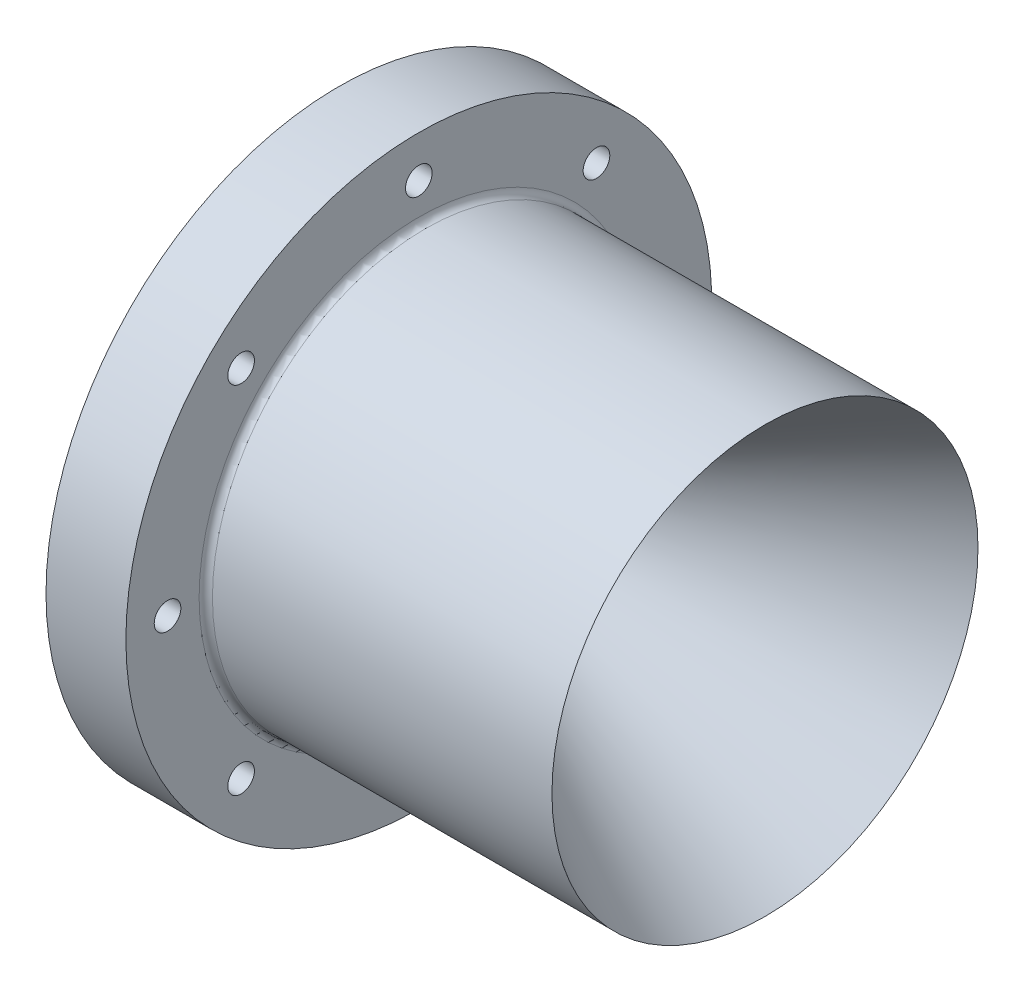
ISO-10303-21;
HEADER;
FILE_DESCRIPTION(('STEP AP214'),'2;1');
FILE_NAME('part.step','',(''),(''),'','','');
FILE_SCHEMA(('AUTOMOTIVE_DESIGN { 1 0 10303 214 1 1 1 1 }'));
ENDSEC;
DATA;
#1=APPLICATION_CONTEXT('core data for automotive mechanical design processes');
#2=APPLICATION_PROTOCOL_DEFINITION('international standard','automotive_design',2000,#1);
#3=PRODUCT_CONTEXT('',#1,'mechanical');
#4=PRODUCT('Part','Part','',(#3));
#5=PRODUCT_RELATED_PRODUCT_CATEGORY('part','',(#4));
#6=PRODUCT_DEFINITION_FORMATION('','',#4);
#7=PRODUCT_DEFINITION_CONTEXT('part definition',#1,'design');
#8=PRODUCT_DEFINITION('design','',#6,#7);
#9=PRODUCT_DEFINITION_SHAPE('','',#8);
#10=(LENGTH_UNIT() NAMED_UNIT(*) SI_UNIT(.MILLI.,.METRE.));
#11=(NAMED_UNIT(*) PLANE_ANGLE_UNIT() SI_UNIT($,.RADIAN.));
#12=(NAMED_UNIT(*) SI_UNIT($,.STERADIAN.) SOLID_ANGLE_UNIT());
#13=UNCERTAINTY_MEASURE_WITH_UNIT(LENGTH_MEASURE(1.E-05),#10,'distance_accuracy_value','');
#14=(GEOMETRIC_REPRESENTATION_CONTEXT(3) GLOBAL_UNCERTAINTY_ASSIGNED_CONTEXT((#13)) GLOBAL_UNIT_ASSIGNED_CONTEXT((#10,
#11,#12)) REPRESENTATION_CONTEXT('',''));
#15=CARTESIAN_POINT('',(0.,0.,0.));
#16=DIRECTION('',(0.,0.,1.));
#17=DIRECTION('',(1.,0.,0.));
#18=AXIS2_PLACEMENT_3D('',#15,#16,#17);
#19=CARTESIAN_POINT('',(0.,0.,0.));
#20=DIRECTION('',(-1.,0.,0.));
#21=DIRECTION('',(0.,0.,1.));
#22=AXIS2_PLACEMENT_3D('',#19,#20,#21);
#23=CYLINDRICAL_SURFACE('',#22,50.8);
#24=CARTESIAN_POINT('',(-9.47210291759363,0.,0.));
#25=DIRECTION('',(-1.,0.,0.));
#26=DIRECTION('',(0.,0.,1.));
#27=AXIS2_PLACEMENT_3D('',#24,#25,#26);
#28=CIRCLE('',#27,50.8);
#29=CARTESIAN_POINT('',(-9.47210291759363,0.,50.8));
#30=VERTEX_POINT('',#29);
#31=EDGE_CURVE('E12',#30,#30,#28,.F.);
#32=ORIENTED_EDGE('',*,*,#31,.T.);
#33=EDGE_LOOP('',(#32));
#34=FACE_BOUND('',#33,.T.);
#35=CARTESIAN_POINT('',(71.4903970824064,0.,0.));
#36=DIRECTION('',(-1.,0.,0.));
#37=DIRECTION('',(0.,0.,1.));
#38=AXIS2_PLACEMENT_3D('',#35,#36,#37);
#39=CIRCLE('',#38,50.8);
#40=CARTESIAN_POINT('',(71.4903970824064,0.,50.8));
#41=VERTEX_POINT('',#40);
#42=EDGE_CURVE('E96',#41,#41,#39,.T.);
#43=ORIENTED_EDGE('',*,*,#42,.T.);
#44=EDGE_LOOP('',(#43));
#45=FACE_BOUND('',#44,.T.);
#46=ADVANCED_FACE('F50',(#34,#45),#23,.T.);
#47=CARTESIAN_POINT('',(-11.0596029175936,69.85,0.));
#48=DIRECTION('',(-1.,0.,0.));
#49=DIRECTION('',(0.,0.,1.));
#50=AXIS2_PLACEMENT_3D('',#47,#48,#49);
#51=PLANE('',#50);
#52=CARTESIAN_POINT('',(-11.0596029175936,0.,0.));
#53=DIRECTION('',(-1.,0.,0.));
#54=DIRECTION('',(0.,0.,1.));
#55=AXIS2_PLACEMENT_3D('',#52,#53,#54);
#56=CIRCLE('',#55,52.3875);
#57=CARTESIAN_POINT('',(-11.0596029175936,0.,52.3875));
#58=VERTEX_POINT('',#57);
#59=EDGE_CURVE('E58',#58,#58,#56,.T.);
#60=ORIENTED_EDGE('',*,*,#59,.T.);
#61=EDGE_LOOP('',(#60));
#62=FACE_BOUND('',#61,.T.);
#63=CARTESIAN_POINT('',(-11.0596029175936,59.9186,0.));
#64=DIRECTION('',(-1.,0.,0.));
#65=DIRECTION('',(0.,0.,1.));
#66=AXIS2_PLACEMENT_3D('',#63,#64,#65);
#67=CIRCLE('',#66,3.175);
#68=CARTESIAN_POINT('',(-11.0596029175936,59.9186,3.175));
#69=VERTEX_POINT('',#68);
#70=EDGE_CURVE('E100',#69,#69,#67,.F.);
#71=ORIENTED_EDGE('',*,*,#70,.F.);
#72=EDGE_LOOP('',(#71));
#73=FACE_BOUND('',#72,.T.);
#74=CARTESIAN_POINT('',(-11.0596029175936,42.3688483792054,42.3688483792047));
#75=DIRECTION('',(-1.,0.,0.));
#76=DIRECTION('',(0.,0.,1.));
#77=AXIS2_PLACEMENT_3D('',#74,#75,#76);
#78=CIRCLE('',#77,3.17500000000024);
#79=CARTESIAN_POINT('',(-11.0596029175936,42.3688483792054,45.543848379205));
#80=VERTEX_POINT('',#79);
#81=EDGE_CURVE('E149',#80,#80,#78,.F.);
#82=ORIENTED_EDGE('',*,*,#81,.F.);
#83=EDGE_LOOP('',(#82));
#84=FACE_BOUND('',#83,.T.);
#85=CARTESIAN_POINT('',(-11.0596029175936,1.61747136534687E-12,59.9186000000016));
#86=DIRECTION('',(-1.,0.,0.));
#87=DIRECTION('',(0.,0.,1.));
#88=AXIS2_PLACEMENT_3D('',#85,#86,#87);
#89=CIRCLE('',#88,3.175);
#90=CARTESIAN_POINT('',(-11.0596029175936,1.61747136534687E-12,63.0936000000016));
#91=VERTEX_POINT('',#90);
#92=EDGE_CURVE('E141',#91,#91,#89,.F.);
#93=ORIENTED_EDGE('',*,*,#92,.F.);
#94=EDGE_LOOP('',(#93));
#95=FACE_BOUND('',#94,.T.);
#96=CARTESIAN_POINT('',(-11.0596029175936,-42.3688483792031,42.368848379207));
#97=DIRECTION('',(-1.,0.,0.));
#98=DIRECTION('',(0.,0.,1.));
#99=AXIS2_PLACEMENT_3D('',#96,#97,#98);
#100=CIRCLE('',#99,3.175);
#101=CARTESIAN_POINT('',(-11.0596029175936,-42.3688483792031,45.543848379207));
#102=VERTEX_POINT('',#101);
#103=EDGE_CURVE('E133',#102,#102,#100,.F.);
#104=ORIENTED_EDGE('',*,*,#103,.F.);
#105=EDGE_LOOP('',(#104));
#106=FACE_BOUND('',#105,.T.);
#107=CARTESIAN_POINT('',(-11.0596029175936,-59.9186,3.23494273069374E-12));
#108=DIRECTION('',(-1.,0.,0.));
#109=DIRECTION('',(0.,0.,1.));
#110=AXIS2_PLACEMENT_3D('',#107,#108,#109);
#111=CIRCLE('',#110,3.175);
#112=CARTESIAN_POINT('',(-11.0596029175936,-59.9186,3.17500000000323));
#113=VERTEX_POINT('',#112);
#114=EDGE_CURVE('E125',#113,#113,#111,.F.);
#115=ORIENTED_EDGE('',*,*,#114,.F.);
#116=EDGE_LOOP('',(#115));
#117=FACE_BOUND('',#116,.T.);
#118=CARTESIAN_POINT('',(-11.0596029175936,-42.3688483792054,-42.3688483792015));
#119=DIRECTION('',(-1.,0.,0.));
#120=DIRECTION('',(0.,0.,1.));
#121=AXIS2_PLACEMENT_3D('',#118,#119,#120);
#122=CIRCLE('',#121,3.175);
#123=CARTESIAN_POINT('',(-11.0596029175936,-42.3688483792054,-39.1938483792015));
#124=VERTEX_POINT('',#123);
#125=EDGE_CURVE('E117',#124,#124,#122,.F.);
#126=ORIENTED_EDGE('',*,*,#125,.F.);
#127=EDGE_LOOP('',(#126));
#128=FACE_BOUND('',#127,.T.);
#129=CARTESIAN_POINT('',(-11.0596029175936,-1.62480927751681E-12,-59.9185999999984));
#130=DIRECTION('',(-1.,0.,0.));
#131=DIRECTION('',(0.,0.,1.));
#132=AXIS2_PLACEMENT_3D('',#129,#130,#131);
#133=CIRCLE('',#132,3.175);
#134=CARTESIAN_POINT('',(-11.0596029175936,-1.62480927751681E-12,-56.7435999999984));
#135=VERTEX_POINT('',#134);
#136=EDGE_CURVE('E110',#135,#135,#133,.F.);
#137=ORIENTED_EDGE('',*,*,#136,.F.);
#138=EDGE_LOOP('',(#137));
#139=FACE_BOUND('',#138,.T.);
#140=CARTESIAN_POINT('',(-11.0596029175936,42.3688483792031,-42.3688483792038));
#141=DIRECTION('',(-1.,0.,0.));
#142=DIRECTION('',(0.,0.,1.));
#143=AXIS2_PLACEMENT_3D('',#140,#141,#142);
#144=CIRCLE('',#143,3.175);
#145=CARTESIAN_POINT('',(-11.0596029175936,42.3688483792031,-39.1938483792038));
#146=VERTEX_POINT('',#145);
#147=EDGE_CURVE('E101',#146,#146,#144,.F.);
#148=ORIENTED_EDGE('',*,*,#147,.F.);
#149=EDGE_LOOP('',(#148));
#150=FACE_BOUND('',#149,.T.);
#151=CARTESIAN_POINT('',(-11.0596029175936,0.,0.));
#152=DIRECTION('',(-1.,0.,0.));
#153=DIRECTION('',(0.,0.,1.));
#154=AXIS2_PLACEMENT_3D('',#151,#152,#153);
#155=CIRCLE('',#154,69.85);
#156=CARTESIAN_POINT('',(-11.0596029175936,0.,69.85));
#157=VERTEX_POINT('',#156);
#158=EDGE_CURVE('E86',#157,#157,#155,.T.);
#159=ORIENTED_EDGE('',*,*,#158,.F.);
#160=EDGE_LOOP('',(#159));
#161=FACE_BOUND('',#160,.T.);
#162=ADVANCED_FACE('F192',(#62,#73,#84,#95,#106,#117,#128,#139,#150,#161),#51,.F.);
#163=CARTESIAN_POINT('',(0.,0.,0.));
#164=DIRECTION('',(-1.,0.,0.));
#165=DIRECTION('',(0.,0.,1.));
#166=AXIS2_PLACEMENT_3D('',#163,#164,#165);
#167=CYLINDRICAL_SURFACE('',#166,69.85);
#168=CARTESIAN_POINT('',(-30.1096029175936,0.,0.));
#169=DIRECTION('',(-1.,0.,0.));
#170=DIRECTION('',(0.,0.,1.));
#171=AXIS2_PLACEMENT_3D('',#168,#169,#170);
#172=CIRCLE('',#171,69.85);
#173=CARTESIAN_POINT('',(-30.1096029175936,0.,69.85));
#174=VERTEX_POINT('',#173);
#175=EDGE_CURVE('E90',#174,#174,#172,.T.);
#176=ORIENTED_EDGE('',*,*,#175,.F.);
#177=EDGE_LOOP('',(#176));
#178=FACE_BOUND('',#177,.T.);
#179=ORIENTED_EDGE('',*,*,#158,.T.);
#180=EDGE_LOOP('',(#179));
#181=FACE_BOUND('',#180,.T.);
#182=ADVANCED_FACE('F170',(#178,#181),#167,.T.);
#183=CARTESIAN_POINT('',(-30.1096029175936,50.8,0.));
#184=DIRECTION('',(1.,0.,0.));
#185=DIRECTION('',(0.,0.,-1.));
#186=AXIS2_PLACEMENT_3D('',#183,#184,#185);
#187=PLANE('',#186);
#188=CARTESIAN_POINT('',(-30.1096029175936,59.9186,0.));
#189=DIRECTION('',(-1.,0.,0.));
#190=DIRECTION('',(0.,0.,1.));
#191=AXIS2_PLACEMENT_3D('',#188,#189,#190);
#192=CIRCLE('',#191,3.175);
#193=CARTESIAN_POINT('',(-30.1096029175936,59.9186,3.175));
#194=VERTEX_POINT('',#193);
#195=EDGE_CURVE('E152',#194,#194,#192,.T.);
#196=ORIENTED_EDGE('',*,*,#195,.F.);
#197=EDGE_LOOP('',(#196));
#198=FACE_BOUND('',#197,.T.);
#199=CARTESIAN_POINT('',(-30.1096029175936,42.3688483792054,42.3688483792047));
#200=DIRECTION('',(-1.,0.,0.));
#201=DIRECTION('',(0.,0.,1.));
#202=AXIS2_PLACEMENT_3D('',#199,#200,#201);
#203=CIRCLE('',#202,3.17500000000024);
#204=CARTESIAN_POINT('',(-30.1096029175936,42.3688483792054,45.543848379205));
#205=VERTEX_POINT('',#204);
#206=EDGE_CURVE('E145',#205,#205,#203,.T.);
#207=ORIENTED_EDGE('',*,*,#206,.F.);
#208=EDGE_LOOP('',(#207));
#209=FACE_BOUND('',#208,.T.);
#210=CARTESIAN_POINT('',(-30.1096029175936,1.61747136534687E-12,59.9186000000016));
#211=DIRECTION('',(-1.,0.,0.));
#212=DIRECTION('',(0.,0.,1.));
#213=AXIS2_PLACEMENT_3D('',#210,#211,#212);
#214=CIRCLE('',#213,3.175);
#215=CARTESIAN_POINT('',(-30.1096029175936,1.61747136534687E-12,63.0936000000016));
#216=VERTEX_POINT('',#215);
#217=EDGE_CURVE('E137',#216,#216,#214,.T.);
#218=ORIENTED_EDGE('',*,*,#217,.F.);
#219=EDGE_LOOP('',(#218));
#220=FACE_BOUND('',#219,.T.);
#221=CARTESIAN_POINT('',(-30.1096029175936,-42.3688483792031,42.368848379207));
#222=DIRECTION('',(-1.,0.,0.));
#223=DIRECTION('',(0.,0.,1.));
#224=AXIS2_PLACEMENT_3D('',#221,#222,#223);
#225=CIRCLE('',#224,3.175);
#226=CARTESIAN_POINT('',(-30.1096029175936,-42.3688483792031,45.543848379207));
#227=VERTEX_POINT('',#226);
#228=EDGE_CURVE('E129',#227,#227,#225,.T.);
#229=ORIENTED_EDGE('',*,*,#228,.F.);
#230=EDGE_LOOP('',(#229));
#231=FACE_BOUND('',#230,.T.);
#232=CARTESIAN_POINT('',(-30.1096029175936,-59.9186,3.23494273069374E-12));
#233=DIRECTION('',(-1.,0.,0.));
#234=DIRECTION('',(0.,0.,1.));
#235=AXIS2_PLACEMENT_3D('',#232,#233,#234);
#236=CIRCLE('',#235,3.175);
#237=CARTESIAN_POINT('',(-30.1096029175936,-59.9186,3.17500000000323));
#238=VERTEX_POINT('',#237);
#239=EDGE_CURVE('E121',#238,#238,#236,.T.);
#240=ORIENTED_EDGE('',*,*,#239,.F.);
#241=EDGE_LOOP('',(#240));
#242=FACE_BOUND('',#241,.T.);
#243=CARTESIAN_POINT('',(-30.1096029175936,-42.3688483792054,-42.3688483792015));
#244=DIRECTION('',(-1.,0.,0.));
#245=DIRECTION('',(0.,0.,1.));
#246=AXIS2_PLACEMENT_3D('',#243,#244,#245);
#247=CIRCLE('',#246,3.175);
#248=CARTESIAN_POINT('',(-30.1096029175936,-42.3688483792054,-39.1938483792015));
#249=VERTEX_POINT('',#248);
#250=EDGE_CURVE('E114',#249,#249,#247,.T.);
#251=ORIENTED_EDGE('',*,*,#250,.F.);
#252=EDGE_LOOP('',(#251));
#253=FACE_BOUND('',#252,.T.);
#254=CARTESIAN_POINT('',(-30.1096029175936,-1.62480927751681E-12,-59.9185999999984));
#255=DIRECTION('',(-1.,0.,0.));
#256=DIRECTION('',(0.,0.,1.));
#257=AXIS2_PLACEMENT_3D('',#254,#255,#256);
#258=CIRCLE('',#257,3.175);
#259=CARTESIAN_POINT('',(-30.1096029175936,-1.62480927751681E-12,-56.7435999999984));
#260=VERTEX_POINT('',#259);
#261=EDGE_CURVE('E105',#260,#260,#258,.T.);
#262=ORIENTED_EDGE('',*,*,#261,.F.);
#263=EDGE_LOOP('',(#262));
#264=FACE_BOUND('',#263,.T.);
#265=CARTESIAN_POINT('',(-30.1096029175936,42.3688483792031,-42.3688483792038));
#266=DIRECTION('',(-1.,0.,0.));
#267=DIRECTION('',(0.,0.,1.));
#268=AXIS2_PLACEMENT_3D('',#265,#266,#267);
#269=CIRCLE('',#268,3.175);
#270=CARTESIAN_POINT('',(-30.1096029175936,42.3688483792031,-39.1938483792038));
#271=VERTEX_POINT('',#270);
#272=EDGE_CURVE('E106',#271,#271,#269,.T.);
#273=ORIENTED_EDGE('',*,*,#272,.F.);
#274=EDGE_LOOP('',(#273));
#275=FACE_BOUND('',#274,.T.);
#276=CARTESIAN_POINT('',(-30.1096029175936,0.,0.));
#277=DIRECTION('',(-1.,0.,0.));
#278=DIRECTION('',(0.,0.,1.));
#279=AXIS2_PLACEMENT_3D('',#276,#277,#278);
#280=CIRCLE('',#279,39.6793167928712);
#281=CARTESIAN_POINT('',(-30.1096029175936,0.,39.6793167928712));
#282=VERTEX_POINT('',#281);
#283=EDGE_CURVE('E93',#282,#282,#280,.T.);
#284=ORIENTED_EDGE('',*,*,#283,.F.);
#285=EDGE_LOOP('',(#284));
#286=FACE_BOUND('',#285,.T.);
#287=ORIENTED_EDGE('',*,*,#175,.T.);
#288=EDGE_LOOP('',(#287));
#289=FACE_BOUND('',#288,.T.);
#290=ADVANCED_FACE('F166',(#198,#209,#220,#231,#242,#253,#264,#275,#286,#289),#187,.F.);
#291=CARTESIAN_POINT('',(-30.1096029175936,0.,0.));
#292=DIRECTION('',(-1.,0.,0.));
#293=DIRECTION('',(0.,0.,1.));
#294=AXIS2_PLACEMENT_3D('',#291,#292,#293);
#295=CONICAL_SURFACE('',#294,39.6793167928712,1.04719755119659);
#296=CARTESIAN_POINT('',(-13.6165435523385,0.,0.));
#297=DIRECTION('',(1.,0.,0.));
#298=DIRECTION('',(0.,0.,-1.));
#299=AXIS2_PLACEMENT_3D('',#296,#297,#298);
#300=CIRCLE('',#299,11.1125);
#301=CARTESIAN_POINT('',(-13.6165435523385,0.,-11.1125));
#302=VERTEX_POINT('',#301);
#303=EDGE_CURVE('E65',#302,#302,#300,.T.);
#304=ORIENTED_EDGE('',*,*,#303,.T.);
#305=EDGE_LOOP('',(#304));
#306=FACE_BOUND('',#305,.T.);
#307=ORIENTED_EDGE('',*,*,#283,.T.);
#308=EDGE_LOOP('',(#307));
#309=FACE_BOUND('',#308,.T.);
#310=ADVANCED_FACE('F169',(#306,#309),#295,.F.);
#311=CARTESIAN_POINT('',(0.,0.,0.));
#312=DIRECTION('',(-1.,0.,0.));
#313=DIRECTION('',(0.,0.,1.));
#314=AXIS2_PLACEMENT_3D('',#311,#312,#313);
#315=CYLINDRICAL_SURFACE('',#314,9.52500000000001);
#316=CARTESIAN_POINT('',(-0.850738685968794,0.,0.));
#317=DIRECTION('',(1.,0.,0.));
#318=DIRECTION('',(0.,0.,-1.));
#319=AXIS2_PLACEMENT_3D('',#316,#317,#318);
#320=CIRCLE('',#319,9.52500000000001);
#321=CARTESIAN_POINT('',(-0.850738685968794,0.,-9.52500000000001));
#322=VERTEX_POINT('',#321);
#323=EDGE_CURVE('E72',#322,#322,#320,.T.);
#324=ORIENTED_EDGE('',*,*,#323,.T.);
#325=EDGE_LOOP('',(#324));
#326=FACE_BOUND('',#325,.T.);
#327=CARTESIAN_POINT('',(-10.8669128953229,0.,0.));
#328=DIRECTION('',(1.,0.,0.));
#329=DIRECTION('',(0.,0.,-1.));
#330=AXIS2_PLACEMENT_3D('',#327,#328,#329);
#331=CIRCLE('',#330,9.52500000000001);
#332=CARTESIAN_POINT('',(-10.8669128953229,0.,-9.52500000000001));
#333=VERTEX_POINT('',#332);
#334=EDGE_CURVE('E78',#333,#333,#331,.F.);
#335=ORIENTED_EDGE('',*,*,#334,.T.);
#336=EDGE_LOOP('',(#335));
#337=FACE_BOUND('',#336,.T.);
#338=ADVANCED_FACE('F218',(#326,#337),#315,.F.);
#339=CARTESIAN_POINT('',(0.,0.,0.));
#340=DIRECTION('',(1.,0.,0.));
#341=DIRECTION('',(0.,0.,-1.));
#342=AXIS2_PLACEMENT_3D('',#339,#340,#341);
#343=CONICAL_SURFACE('',#342,9.525,0.523598775598293);
#344=CARTESIAN_POINT('',(0.736761314031192,0.,0.));
#345=DIRECTION('',(-1.,0.,0.));
#346=DIRECTION('',(0.,0.,1.));
#347=AXIS2_PLACEMENT_3D('',#344,#345,#346);
#348=CIRCLE('',#347,9.95036934298441);
#349=CARTESIAN_POINT('',(0.736761314031192,0.,9.95036934298441));
#350=VERTEX_POINT('',#349);
#351=EDGE_CURVE('E82',#350,#350,#348,.T.);
#352=ORIENTED_EDGE('',*,*,#351,.T.);
#353=EDGE_LOOP('',(#352));
#354=FACE_BOUND('',#353,.T.);
#355=ORIENTED_EDGE('',*,*,#42,.F.);
#356=EDGE_LOOP('',(#355));
#357=FACE_BOUND('',#356,.T.);
#358=ADVANCED_FACE('F220',(#354,#357),#343,.F.);
#359=CARTESIAN_POINT('',(71.4913970824064,42.3688483792031,-42.3688483792038));
#360=DIRECTION('',(-1.,0.,0.));
#361=DIRECTION('',(0.,0.,1.));
#362=AXIS2_PLACEMENT_3D('',#359,#360,#361);
#363=CYLINDRICAL_SURFACE('',#362,3.175);
#364=ORIENTED_EDGE('',*,*,#272,.T.);
#365=EDGE_LOOP('',(#364));
#366=FACE_BOUND('',#365,.T.);
#367=ORIENTED_EDGE('',*,*,#147,.T.);
#368=EDGE_LOOP('',(#367));
#369=FACE_BOUND('',#368,.T.);
#370=ADVANCED_FACE('F227',(#366,#369),#363,.F.);
#371=CARTESIAN_POINT('',(71.4913970824064,-1.62480927751681E-12,-59.9185999999984));
#372=DIRECTION('',(-1.,0.,0.));
#373=DIRECTION('',(0.,0.,1.));
#374=AXIS2_PLACEMENT_3D('',#371,#372,#373);
#375=CYLINDRICAL_SURFACE('',#374,3.175);
#376=ORIENTED_EDGE('',*,*,#261,.T.);
#377=EDGE_LOOP('',(#376));
#378=FACE_BOUND('',#377,.T.);
#379=ORIENTED_EDGE('',*,*,#136,.T.);
#380=EDGE_LOOP('',(#379));
#381=FACE_BOUND('',#380,.T.);
#382=ADVANCED_FACE('F235',(#378,#381),#375,.F.);
#383=CARTESIAN_POINT('',(71.4913970824064,-42.3688483792054,-42.3688483792015));
#384=DIRECTION('',(-1.,0.,0.));
#385=DIRECTION('',(0.,0.,1.));
#386=AXIS2_PLACEMENT_3D('',#383,#384,#385);
#387=CYLINDRICAL_SURFACE('',#386,3.175);
#388=ORIENTED_EDGE('',*,*,#250,.T.);
#389=EDGE_LOOP('',(#388));
#390=FACE_BOUND('',#389,.T.);
#391=ORIENTED_EDGE('',*,*,#125,.T.);
#392=EDGE_LOOP('',(#391));
#393=FACE_BOUND('',#392,.T.);
#394=ADVANCED_FACE('F239',(#390,#393),#387,.F.);
#395=CARTESIAN_POINT('',(71.4913970824064,-59.9186,3.23494273069374E-12));
#396=DIRECTION('',(-1.,0.,0.));
#397=DIRECTION('',(0.,0.,1.));
#398=AXIS2_PLACEMENT_3D('',#395,#396,#397);
#399=CYLINDRICAL_SURFACE('',#398,3.175);
#400=ORIENTED_EDGE('',*,*,#239,.T.);
#401=EDGE_LOOP('',(#400));
#402=FACE_BOUND('',#401,.T.);
#403=ORIENTED_EDGE('',*,*,#114,.T.);
#404=EDGE_LOOP('',(#403));
#405=FACE_BOUND('',#404,.T.);
#406=ADVANCED_FACE('F243',(#402,#405),#399,.F.);
#407=CARTESIAN_POINT('',(71.4913970824064,-42.3688483792031,42.368848379207));
#408=DIRECTION('',(-1.,0.,0.));
#409=DIRECTION('',(0.,0.,1.));
#410=AXIS2_PLACEMENT_3D('',#407,#408,#409);
#411=CYLINDRICAL_SURFACE('',#410,3.175);
#412=ORIENTED_EDGE('',*,*,#228,.T.);
#413=EDGE_LOOP('',(#412));
#414=FACE_BOUND('',#413,.T.);
#415=ORIENTED_EDGE('',*,*,#103,.T.);
#416=EDGE_LOOP('',(#415));
#417=FACE_BOUND('',#416,.T.);
#418=ADVANCED_FACE('F247',(#414,#417),#411,.F.);
#419=CARTESIAN_POINT('',(71.4913970824064,1.61747136534687E-12,59.9186000000016));
#420=DIRECTION('',(-1.,0.,0.));
#421=DIRECTION('',(0.,0.,1.));
#422=AXIS2_PLACEMENT_3D('',#419,#420,#421);
#423=CYLINDRICAL_SURFACE('',#422,3.175);
#424=ORIENTED_EDGE('',*,*,#217,.T.);
#425=EDGE_LOOP('',(#424));
#426=FACE_BOUND('',#425,.T.);
#427=ORIENTED_EDGE('',*,*,#92,.T.);
#428=EDGE_LOOP('',(#427));
#429=FACE_BOUND('',#428,.T.);
#430=ADVANCED_FACE('F251',(#426,#429),#423,.F.);
#431=CARTESIAN_POINT('',(71.4913970824064,42.3688483792054,42.3688483792047));
#432=DIRECTION('',(-1.,0.,0.));
#433=DIRECTION('',(0.,0.,1.));
#434=AXIS2_PLACEMENT_3D('',#431,#432,#433);
#435=CYLINDRICAL_SURFACE('',#434,3.17500000000024);
#436=ORIENTED_EDGE('',*,*,#206,.T.);
#437=EDGE_LOOP('',(#436));
#438=FACE_BOUND('',#437,.T.);
#439=ORIENTED_EDGE('',*,*,#81,.T.);
#440=EDGE_LOOP('',(#439));
#441=FACE_BOUND('',#440,.T.);
#442=ADVANCED_FACE('F255',(#438,#441),#435,.F.);
#443=CARTESIAN_POINT('',(71.4913970824064,59.9186,0.));
#444=DIRECTION('',(-1.,0.,0.));
#445=DIRECTION('',(0.,0.,1.));
#446=AXIS2_PLACEMENT_3D('',#443,#444,#445);
#447=CYLINDRICAL_SURFACE('',#446,3.175);
#448=ORIENTED_EDGE('',*,*,#195,.T.);
#449=EDGE_LOOP('',(#448));
#450=FACE_BOUND('',#449,.T.);
#451=ORIENTED_EDGE('',*,*,#70,.T.);
#452=EDGE_LOOP('',(#451));
#453=FACE_BOUND('',#452,.T.);
#454=ADVANCED_FACE('F163',(#450,#453),#447,.F.);
#455=CARTESIAN_POINT('',(-0.850738685968794,0.,0.));
#456=DIRECTION('',(1.,0.,0.));
#457=DIRECTION('',(0.,0.,-1.));
#458=AXIS2_PLACEMENT_3D('',#455,#456,#457);
#459=TOROIDAL_SURFACE('',#458,12.7,3.175);
#460=ORIENTED_EDGE('',*,*,#323,.F.);
#461=EDGE_LOOP('',(#460));
#462=FACE_BOUND('',#461,.T.);
#463=ORIENTED_EDGE('',*,*,#351,.F.);
#464=EDGE_LOOP('',(#463));
#465=FACE_BOUND('',#464,.T.);
#466=ADVANCED_FACE('F204',(#462,#465),#459,.T.);
#467=CARTESIAN_POINT('',(-10.8669128953229,0.,0.));
#468=DIRECTION('',(1.,0.,0.));
#469=DIRECTION('',(0.,0.,-1.));
#470=AXIS2_PLACEMENT_3D('',#467,#468,#469);
#471=TOROIDAL_SURFACE('',#470,12.7,3.175);
#472=ORIENTED_EDGE('',*,*,#303,.F.);
#473=EDGE_LOOP('',(#472));
#474=FACE_BOUND('',#473,.T.);
#475=ORIENTED_EDGE('',*,*,#334,.F.);
#476=EDGE_LOOP('',(#475));
#477=FACE_BOUND('',#476,.T.);
#478=ADVANCED_FACE('F206',(#474,#477),#471,.T.);
#479=CARTESIAN_POINT('',(-9.47210291759363,0.,0.));
#480=DIRECTION('',(-1.,0.,0.));
#481=DIRECTION('',(0.,0.,1.));
#482=AXIS2_PLACEMENT_3D('',#479,#480,#481);
#483=TOROIDAL_SURFACE('',#482,52.3875,1.5875);
#484=ORIENTED_EDGE('',*,*,#31,.F.);
#485=EDGE_LOOP('',(#484));
#486=FACE_BOUND('',#485,.T.);
#487=ORIENTED_EDGE('',*,*,#59,.F.);
#488=EDGE_LOOP('',(#487));
#489=FACE_BOUND('',#488,.T.);
#490=ADVANCED_FACE('F52',(#486,#489),#483,.F.);
#491=CLOSED_SHELL('',(#46,#162,#182,#290,#310,#338,#358,#370,#382,#394,#406,#418,#430,#442,#454,
#466,#478,#490));
#492=MANIFOLD_SOLID_BREP('B2',#491);
#493=ADVANCED_BREP_SHAPE_REPRESENTATION('',(#18,#492),#14);
#494=SHAPE_DEFINITION_REPRESENTATION(#9,#493);
ENDSEC;
END-ISO-10303-21;
